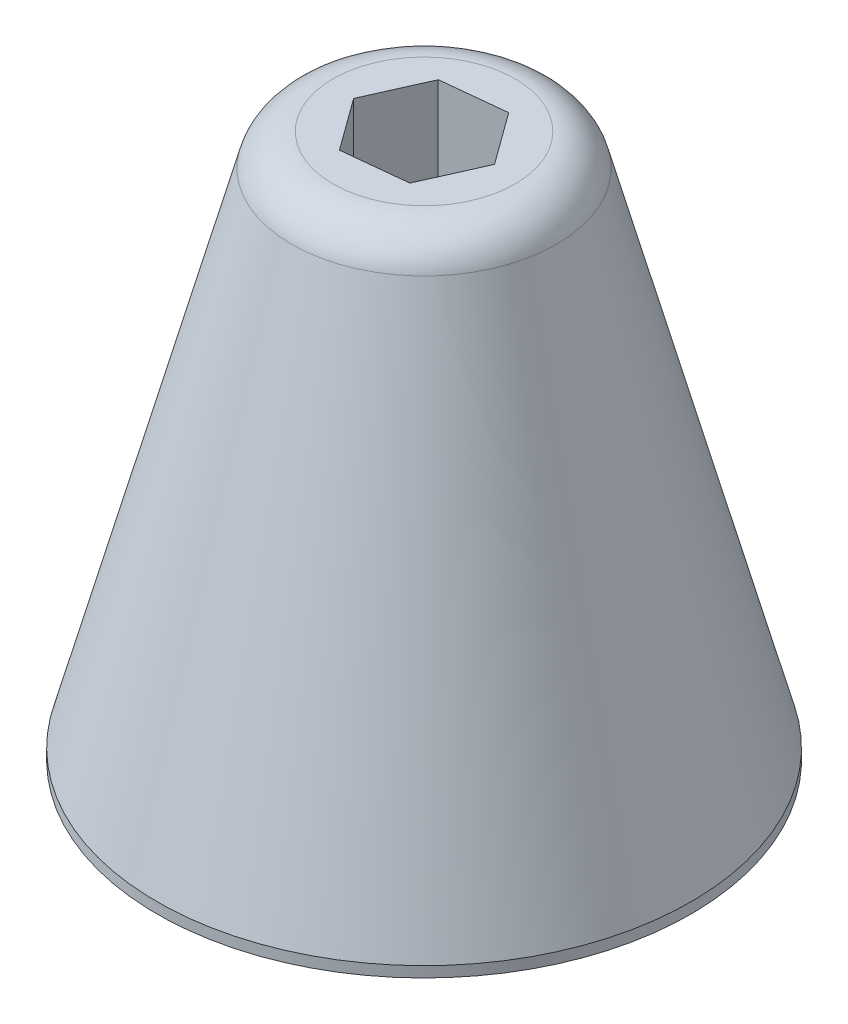
ISO-10303-21;
HEADER;
FILE_DESCRIPTION(('STEP AP214'),'2;1');
FILE_NAME('part.step','',(''),(''),'','','');
FILE_SCHEMA(('AUTOMOTIVE_DESIGN { 1 0 10303 214 1 1 1 1 }'));
ENDSEC;
DATA;
#1=APPLICATION_CONTEXT('core data for automotive mechanical design processes');
#2=APPLICATION_PROTOCOL_DEFINITION('international standard','automotive_design',2000,#1);
#3=PRODUCT_CONTEXT('',#1,'mechanical');
#4=PRODUCT('Part','Part','',(#3));
#5=PRODUCT_RELATED_PRODUCT_CATEGORY('part','',(#4));
#6=PRODUCT_DEFINITION_FORMATION('','',#4);
#7=PRODUCT_DEFINITION_CONTEXT('part definition',#1,'design');
#8=PRODUCT_DEFINITION('design','',#6,#7);
#9=PRODUCT_DEFINITION_SHAPE('','',#8);
#10=(LENGTH_UNIT() NAMED_UNIT(*) SI_UNIT(.MILLI.,.METRE.));
#11=(NAMED_UNIT(*) PLANE_ANGLE_UNIT() SI_UNIT($,.RADIAN.));
#12=(NAMED_UNIT(*) SI_UNIT($,.STERADIAN.) SOLID_ANGLE_UNIT());
#13=UNCERTAINTY_MEASURE_WITH_UNIT(LENGTH_MEASURE(1.E-05),#10,'distance_accuracy_value','');
#14=(GEOMETRIC_REPRESENTATION_CONTEXT(3) GLOBAL_UNCERTAINTY_ASSIGNED_CONTEXT((#13)) GLOBAL_UNIT_ASSIGNED_CONTEXT((#10,
#11,#12)) REPRESENTATION_CONTEXT('',''));
#15=CARTESIAN_POINT('',(0.,0.,0.));
#16=DIRECTION('',(0.,0.,1.));
#17=DIRECTION('',(1.,0.,0.));
#18=AXIS2_PLACEMENT_3D('',#15,#16,#17);
#19=CARTESIAN_POINT('',(0.,0.,0.));
#20=DIRECTION('',(0.,-1.,0.));
#21=DIRECTION('',(0.,0.,1.));
#22=AXIS2_PLACEMENT_3D('',#19,#20,#21);
#23=CONICAL_SURFACE('',#22,31.75,0.26179938779915);
#24=CARTESIAN_POINT('',(0.,59.7348007491208,0.));
#25=DIRECTION('',(0.,-1.,0.));
#26=DIRECTION('',(0.,0.,-1.));
#27=AXIS2_PLACEMENT_3D('',#24,#25,#26);
#28=CIRCLE('',#27,15.744108379239);
#29=CARTESIAN_POINT('',(0.,59.7348007491208,-15.744108379239));
#30=VERTEX_POINT('',#29);
#31=EDGE_CURVE('E11',#30,#30,#28,.T.);
#32=ORIENTED_EDGE('',*,*,#31,.T.);
#33=EDGE_LOOP('',(#32));
#34=FACE_BOUND('',#33,.T.);
#35=CARTESIAN_POINT('',(0.,0.,0.));
#36=DIRECTION('',(0.,-1.,0.));
#37=DIRECTION('',(0.,0.,-1.));
#38=AXIS2_PLACEMENT_3D('',#35,#36,#37);
#39=CIRCLE('',#38,31.75);
#40=CARTESIAN_POINT('',(0.,0.,-31.75));
#41=VERTEX_POINT('',#40);
#42=EDGE_CURVE('E152',#41,#41,#39,.T.);
#43=ORIENTED_EDGE('',*,*,#42,.F.);
#44=EDGE_LOOP('',(#43));
#45=FACE_BOUND('',#44,.T.);
#46=ADVANCED_FACE('F39',(#34,#45),#23,.T.);
#47=CARTESIAN_POINT('',(0.,63.5,0.));
#48=DIRECTION('',(0.,1.,0.));
#49=DIRECTION('',(0.,0.,1.));
#50=AXIS2_PLACEMENT_3D('',#47,#48,#49);
#51=PLANE('',#50);
#52=CARTESIAN_POINT('',(0.,63.5,0.));
#53=DIRECTION('',(0.,1.,0.));
#54=DIRECTION('',(0.,0.,1.));
#55=AXIS2_PLACEMENT_3D('',#52,#53,#54);
#56=CIRCLE('',#55,10.8372051816905);
#57=CARTESIAN_POINT('',(0.,63.5,10.8372051816905));
#58=VERTEX_POINT('',#57);
#59=EDGE_CURVE('E48',#58,#58,#56,.T.);
#60=ORIENTED_EDGE('',*,*,#59,.T.);
#61=EDGE_LOOP('',(#60));
#62=FACE_BOUND('',#61,.T.);
#63=DIRECTION('',(0.994512393452479,0.,-0.104618828465154));
#64=VECTOR('',#63,1.);
#65=CARTESIAN_POINT('',(-3.10099517208497,63.5,6.96665273112123));
#66=LINE('',#65,#64);
#67=CARTESIAN_POINT('',(-3.10099517208497,63.5,6.96665273112123));
#68=VERTEX_POINT('',#67);
#69=CARTESIAN_POINT('',(4.48280065845274,63.5,6.16886696159911));
#70=VERTEX_POINT('',#69);
#71=EDGE_CURVE('E55',#68,#70,#66,.T.);
#72=ORIENTED_EDGE('',*,*,#71,.F.);
#73=DIRECTION('',(0.587858759891229,0.,0.808963582875735));
#74=VECTOR('',#73,1.);
#75=CARTESIAN_POINT('',(-7.58379583053771,63.5,0.797785769522116));
#76=LINE('',#75,#74);
#77=CARTESIAN_POINT('',(-7.58379583053771,63.5,0.797785769522116));
#78=VERTEX_POINT('',#77);
#79=EDGE_CURVE('E124',#78,#68,#76,.T.);
#80=ORIENTED_EDGE('',*,*,#79,.F.);
#81=DIRECTION('',(-0.40665363356125,0.,0.913582411340889));
#82=VECTOR('',#81,1.);
#83=CARTESIAN_POINT('',(-4.48280065845273,63.5,-6.16886696159911));
#84=LINE('',#83,#82);
#85=CARTESIAN_POINT('',(-4.48280065845273,63.5,-6.16886696159911));
#86=VERTEX_POINT('',#85);
#87=EDGE_CURVE('E117',#86,#78,#84,.T.);
#88=ORIENTED_EDGE('',*,*,#87,.F.);
#89=DIRECTION('',(-0.994512393452479,0.,0.104618828465154));
#90=VECTOR('',#89,1.);
#91=CARTESIAN_POINT('',(3.10099517208498,63.5,-6.96665273112123));
#92=LINE('',#91,#90);
#93=CARTESIAN_POINT('',(3.10099517208498,63.5,-6.96665273112123));
#94=VERTEX_POINT('',#93);
#95=EDGE_CURVE('E113',#94,#86,#92,.T.);
#96=ORIENTED_EDGE('',*,*,#95,.F.);
#97=DIRECTION('',(-0.587858759891229,0.,-0.808963582875735));
#98=VECTOR('',#97,1.);
#99=CARTESIAN_POINT('',(7.58379583053772,63.5,-0.797785769522122));
#100=LINE('',#99,#98);
#101=CARTESIAN_POINT('',(7.58379583053772,63.5,-0.797785769522122));
#102=VERTEX_POINT('',#101);
#103=EDGE_CURVE('E95',#102,#94,#100,.T.);
#104=ORIENTED_EDGE('',*,*,#103,.F.);
#105=DIRECTION('',(0.406653633561249,0.,-0.913582411340889));
#106=VECTOR('',#105,1.);
#107=CARTESIAN_POINT('',(4.48280065845274,63.5,6.16886696159911));
#108=LINE('',#107,#106);
#109=EDGE_CURVE('E105',#70,#102,#108,.T.);
#110=ORIENTED_EDGE('',*,*,#109,.F.);
#111=EDGE_LOOP('',(#72,#80,#88,#96,#104,#110));
#112=FACE_BOUND('',#111,.T.);
#113=ADVANCED_FACE('F110',(#62,#112),#51,.T.);
#114=CARTESIAN_POINT('',(0.,-1.27,0.));
#115=DIRECTION('',(0.,1.,0.));
#116=DIRECTION('',(0.,0.,1.));
#117=AXIS2_PLACEMENT_3D('',#114,#115,#116);
#118=CYLINDRICAL_SURFACE('',#117,31.75);
#119=CARTESIAN_POINT('',(0.,-1.27,0.));
#120=DIRECTION('',(0.,-1.,0.));
#121=DIRECTION('',(0.,0.,-1.));
#122=AXIS2_PLACEMENT_3D('',#119,#120,#121);
#123=CIRCLE('',#122,31.75);
#124=CARTESIAN_POINT('',(0.,-1.27,-31.75));
#125=VERTEX_POINT('',#124);
#126=EDGE_CURVE('E163',#125,#125,#123,.T.);
#127=ORIENTED_EDGE('',*,*,#126,.F.);
#128=EDGE_LOOP('',(#127));
#129=FACE_BOUND('',#128,.T.);
#130=ORIENTED_EDGE('',*,*,#42,.T.);
#131=EDGE_LOOP('',(#130));
#132=FACE_BOUND('',#131,.T.);
#133=ADVANCED_FACE('F186',(#129,#132),#118,.T.);
#134=CARTESIAN_POINT('',(0.,-1.27,0.));
#135=DIRECTION('',(0.,-1.,0.));
#136=DIRECTION('',(0.,0.,-1.));
#137=AXIS2_PLACEMENT_3D('',#134,#135,#136);
#138=PLANE('',#137);
#139=DIRECTION('',(0.994512393452479,0.,-0.104618828465154));
#140=VECTOR('',#139,1.);
#141=CARTESIAN_POINT('',(-3.10099517208497,-1.27,6.96665273112123));
#142=LINE('',#141,#140);
#143=CARTESIAN_POINT('',(-3.10099517208497,-1.27,6.96665273112123));
#144=VERTEX_POINT('',#143);
#145=CARTESIAN_POINT('',(4.48280065845274,-1.27,6.16886696159911));
#146=VERTEX_POINT('',#145);
#147=EDGE_CURVE('E128',#144,#146,#142,.T.);
#148=ORIENTED_EDGE('',*,*,#147,.T.);
#149=DIRECTION('',(0.406653633561249,0.,-0.913582411340889));
#150=VECTOR('',#149,1.);
#151=CARTESIAN_POINT('',(4.48280065845274,-1.27,6.16886696159911));
#152=LINE('',#151,#150);
#153=CARTESIAN_POINT('',(7.58379583053772,-1.27,-0.797785769522122));
#154=VERTEX_POINT('',#153);
#155=EDGE_CURVE('E132',#146,#154,#152,.T.);
#156=ORIENTED_EDGE('',*,*,#155,.T.);
#157=DIRECTION('',(-0.587858759891229,0.,-0.808963582875735));
#158=VECTOR('',#157,1.);
#159=CARTESIAN_POINT('',(7.58379583053772,-1.27,-0.797785769522122));
#160=LINE('',#159,#158);
#161=CARTESIAN_POINT('',(3.10099517208498,-1.27,-6.96665273112123));
#162=VERTEX_POINT('',#161);
#163=EDGE_CURVE('E63',#154,#162,#160,.T.);
#164=ORIENTED_EDGE('',*,*,#163,.T.);
#165=DIRECTION('',(-0.994512393452479,0.,0.104618828465154));
#166=VECTOR('',#165,1.);
#167=CARTESIAN_POINT('',(3.10099517208498,-1.27,-6.96665273112123));
#168=LINE('',#167,#166);
#169=CARTESIAN_POINT('',(-4.48280065845273,-1.27,-6.16886696159911));
#170=VERTEX_POINT('',#169);
#171=EDGE_CURVE('E137',#162,#170,#168,.T.);
#172=ORIENTED_EDGE('',*,*,#171,.T.);
#173=DIRECTION('',(-0.40665363356125,0.,0.913582411340889));
#174=VECTOR('',#173,1.);
#175=CARTESIAN_POINT('',(-4.48280065845273,-1.27,-6.16886696159911));
#176=LINE('',#175,#174);
#177=CARTESIAN_POINT('',(-7.58379583053771,-1.27,0.797785769522116));
#178=VERTEX_POINT('',#177);
#179=EDGE_CURVE('E141',#170,#178,#176,.T.);
#180=ORIENTED_EDGE('',*,*,#179,.T.);
#181=DIRECTION('',(0.587858759891229,0.,0.808963582875735));
#182=VECTOR('',#181,1.);
#183=CARTESIAN_POINT('',(-7.58379583053771,-1.27,0.797785769522116));
#184=LINE('',#183,#182);
#185=EDGE_CURVE('E145',#178,#144,#184,.T.);
#186=ORIENTED_EDGE('',*,*,#185,.T.);
#187=EDGE_LOOP('',(#148,#156,#164,#172,#180,#186));
#188=FACE_BOUND('',#187,.T.);
#189=ORIENTED_EDGE('',*,*,#126,.T.);
#190=EDGE_LOOP('',(#189));
#191=FACE_BOUND('',#190,.T.);
#192=ADVANCED_FACE('F192',(#188,#191),#138,.T.);
#193=CARTESIAN_POINT('',(-3.10099517208497,-1.27,6.96665273112123));
#194=DIRECTION('',(0.104618828465154,0.,0.994512393452479));
#195=DIRECTION('',(0.994512393452479,0.,-0.104618828465154));
#196=AXIS2_PLACEMENT_3D('',#193,#194,#195);
#197=PLANE('',#196);
#198=DIRECTION('',(0.,1.,0.));
#199=VECTOR('',#198,1.);
#200=CARTESIAN_POINT('',(4.48280065845274,-1.27,6.16886696159911));
#201=LINE('',#200,#199);
#202=EDGE_CURVE('E102',#146,#70,#201,.T.);
#203=ORIENTED_EDGE('',*,*,#202,.F.);
#204=ORIENTED_EDGE('',*,*,#147,.F.);
#205=DIRECTION('',(0.,1.,0.));
#206=VECTOR('',#205,1.);
#207=CARTESIAN_POINT('',(-3.10099517208497,-1.27,6.96665273112123));
#208=LINE('',#207,#206);
#209=EDGE_CURVE('E149',#144,#68,#208,.T.);
#210=ORIENTED_EDGE('',*,*,#209,.T.);
#211=ORIENTED_EDGE('',*,*,#71,.T.);
#212=EDGE_LOOP('',(#203,#204,#210,#211));
#213=FACE_BOUND('',#212,.T.);
#214=ADVANCED_FACE('F196',(#213),#197,.F.);
#215=CARTESIAN_POINT('',(-7.58379583053771,-1.27,0.797785769522116));
#216=DIRECTION('',(-0.808963582875735,0.,0.587858759891229));
#217=DIRECTION('',(0.587858759891229,0.,0.808963582875735));
#218=AXIS2_PLACEMENT_3D('',#215,#216,#217);
#219=PLANE('',#218);
#220=ORIENTED_EDGE('',*,*,#209,.F.);
#221=ORIENTED_EDGE('',*,*,#185,.F.);
#222=DIRECTION('',(0.,1.,0.));
#223=VECTOR('',#222,1.);
#224=CARTESIAN_POINT('',(-7.58379583053771,-1.27,0.797785769522116));
#225=LINE('',#224,#223);
#226=EDGE_CURVE('E153',#178,#78,#225,.T.);
#227=ORIENTED_EDGE('',*,*,#226,.T.);
#228=ORIENTED_EDGE('',*,*,#79,.T.);
#229=EDGE_LOOP('',(#220,#221,#227,#228));
#230=FACE_BOUND('',#229,.T.);
#231=ADVANCED_FACE('F199',(#230),#219,.F.);
#232=CARTESIAN_POINT('',(-4.48280065845273,-1.27,-6.16886696159911));
#233=DIRECTION('',(-0.913582411340889,0.,-0.40665363356125));
#234=DIRECTION('',(-0.40665363356125,0.,0.913582411340889));
#235=AXIS2_PLACEMENT_3D('',#232,#233,#234);
#236=PLANE('',#235);
#237=ORIENTED_EDGE('',*,*,#226,.F.);
#238=ORIENTED_EDGE('',*,*,#179,.F.);
#239=DIRECTION('',(0.,1.,0.));
#240=VECTOR('',#239,1.);
#241=CARTESIAN_POINT('',(-4.48280065845273,-1.27,-6.16886696159911));
#242=LINE('',#241,#240);
#243=EDGE_CURVE('E156',#170,#86,#242,.T.);
#244=ORIENTED_EDGE('',*,*,#243,.T.);
#245=ORIENTED_EDGE('',*,*,#87,.T.);
#246=EDGE_LOOP('',(#237,#238,#244,#245));
#247=FACE_BOUND('',#246,.T.);
#248=ADVANCED_FACE('F206',(#247),#236,.F.);
#249=CARTESIAN_POINT('',(3.10099517208498,-1.27,-6.96665273112123));
#250=DIRECTION('',(-0.104618828465154,0.,-0.994512393452479));
#251=DIRECTION('',(-0.994512393452479,0.,0.104618828465154));
#252=AXIS2_PLACEMENT_3D('',#249,#250,#251);
#253=PLANE('',#252);
#254=ORIENTED_EDGE('',*,*,#243,.F.);
#255=ORIENTED_EDGE('',*,*,#171,.F.);
#256=DIRECTION('',(0.,1.,0.));
#257=VECTOR('',#256,1.);
#258=CARTESIAN_POINT('',(3.10099517208498,-1.27,-6.96665273112123));
#259=LINE('',#258,#257);
#260=EDGE_CURVE('E101',#162,#94,#259,.T.);
#261=ORIENTED_EDGE('',*,*,#260,.T.);
#262=ORIENTED_EDGE('',*,*,#95,.T.);
#263=EDGE_LOOP('',(#254,#255,#261,#262));
#264=FACE_BOUND('',#263,.T.);
#265=ADVANCED_FACE('F203',(#264),#253,.F.);
#266=CARTESIAN_POINT('',(7.58379583053772,-1.27,-0.797785769522122));
#267=DIRECTION('',(0.808963582875735,0.,-0.587858759891229));
#268=DIRECTION('',(-0.587858759891229,0.,-0.808963582875735));
#269=AXIS2_PLACEMENT_3D('',#266,#267,#268);
#270=PLANE('',#269);
#271=ORIENTED_EDGE('',*,*,#260,.F.);
#272=ORIENTED_EDGE('',*,*,#163,.F.);
#273=DIRECTION('',(0.,1.,0.));
#274=VECTOR('',#273,1.);
#275=CARTESIAN_POINT('',(7.58379583053772,-1.27,-0.797785769522122));
#276=LINE('',#275,#274);
#277=EDGE_CURVE('E91',#154,#102,#276,.T.);
#278=ORIENTED_EDGE('',*,*,#277,.T.);
#279=ORIENTED_EDGE('',*,*,#103,.T.);
#280=EDGE_LOOP('',(#271,#272,#278,#279));
#281=FACE_BOUND('',#280,.T.);
#282=ADVANCED_FACE('F93',(#281),#270,.F.);
#283=CARTESIAN_POINT('',(4.48280065845274,-1.27,6.16886696159911));
#284=DIRECTION('',(0.913582411340889,0.,0.406653633561249));
#285=DIRECTION('',(0.406653633561249,0.,-0.913582411340889));
#286=AXIS2_PLACEMENT_3D('',#283,#284,#285);
#287=PLANE('',#286);
#288=ORIENTED_EDGE('',*,*,#277,.F.);
#289=ORIENTED_EDGE('',*,*,#155,.F.);
#290=ORIENTED_EDGE('',*,*,#202,.T.);
#291=ORIENTED_EDGE('',*,*,#109,.T.);
#292=EDGE_LOOP('',(#288,#289,#290,#291));
#293=FACE_BOUND('',#292,.T.);
#294=ADVANCED_FACE('F106',(#293),#287,.F.);
#295=CARTESIAN_POINT('',(0.,58.42,0.));
#296=DIRECTION('',(0.,1.,0.));
#297=DIRECTION('',(0.,0.,1.));
#298=AXIS2_PLACEMENT_3D('',#295,#296,#297);
#299=TOROIDAL_SURFACE('',#298,10.8372051816905,5.08);
#300=ORIENTED_EDGE('',*,*,#31,.F.);
#301=EDGE_LOOP('',(#300));
#302=FACE_BOUND('',#301,.T.);
#303=ORIENTED_EDGE('',*,*,#59,.F.);
#304=EDGE_LOOP('',(#303));
#305=FACE_BOUND('',#304,.T.);
#306=ADVANCED_FACE('F41',(#302,#305),#299,.T.);
#307=CLOSED_SHELL('',(#46,#113,#133,#192,#214,#231,#248,#265,#282,#294,#306));
#308=MANIFOLD_SOLID_BREP('B2',#307);
#309=ADVANCED_BREP_SHAPE_REPRESENTATION('',(#18,#308),#14);
#310=SHAPE_DEFINITION_REPRESENTATION(#9,#309);
ENDSEC;
END-ISO-10303-21;
